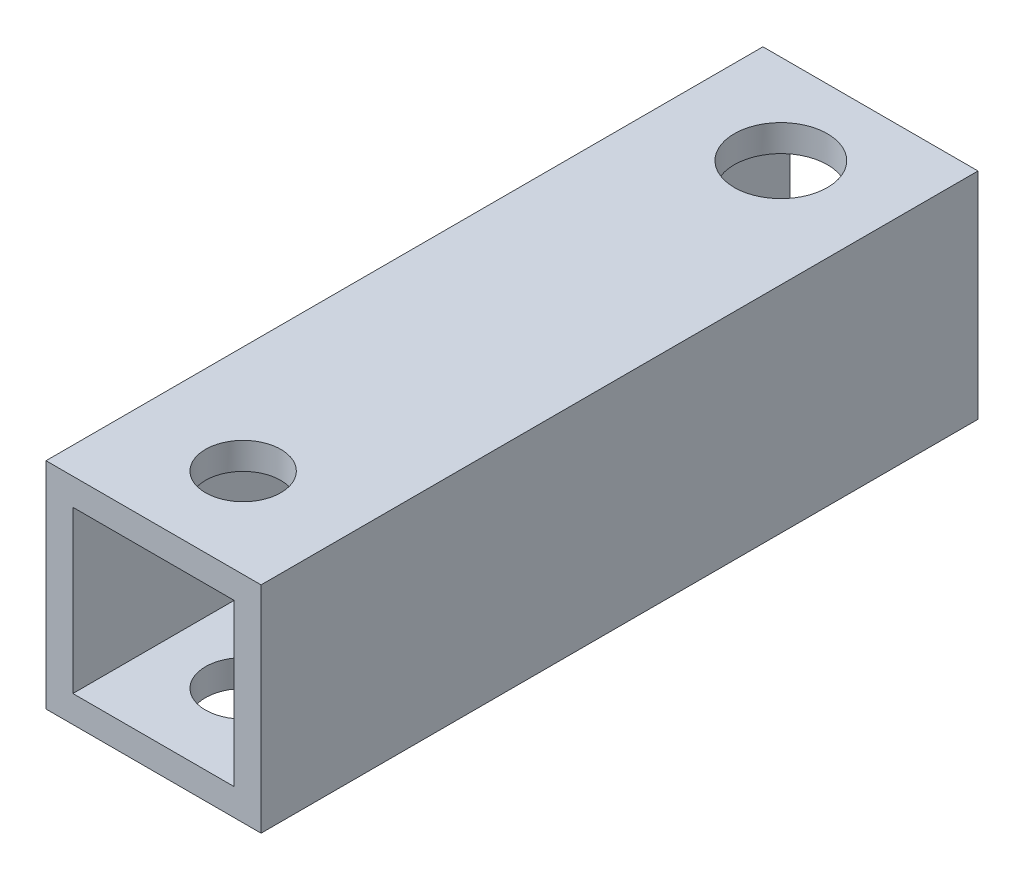
ISO-10303-21;
HEADER;
FILE_DESCRIPTION(('STEP AP214'),'2;1');
FILE_NAME('part.step','',(''),(''),'','','');
FILE_SCHEMA(('AUTOMOTIVE_DESIGN { 1 0 10303 214 1 1 1 1 }'));
ENDSEC;
DATA;
#1=APPLICATION_CONTEXT('core data for automotive mechanical design processes');
#2=APPLICATION_PROTOCOL_DEFINITION('international standard','automotive_design',2000,#1);
#3=PRODUCT_CONTEXT('',#1,'mechanical');
#4=PRODUCT('Part','Part','',(#3));
#5=PRODUCT_RELATED_PRODUCT_CATEGORY('part','',(#4));
#6=PRODUCT_DEFINITION_FORMATION('','',#4);
#7=PRODUCT_DEFINITION_CONTEXT('part definition',#1,'design');
#8=PRODUCT_DEFINITION('design','',#6,#7);
#9=PRODUCT_DEFINITION_SHAPE('','',#8);
#10=(LENGTH_UNIT() NAMED_UNIT(*) SI_UNIT(.MILLI.,.METRE.));
#11=(NAMED_UNIT(*) PLANE_ANGLE_UNIT() SI_UNIT($,.RADIAN.));
#12=(NAMED_UNIT(*) SI_UNIT($,.STERADIAN.) SOLID_ANGLE_UNIT());
#13=UNCERTAINTY_MEASURE_WITH_UNIT(LENGTH_MEASURE(1.E-05),#10,'distance_accuracy_value','');
#14=(GEOMETRIC_REPRESENTATION_CONTEXT(3) GLOBAL_UNCERTAINTY_ASSIGNED_CONTEXT((#13)) GLOBAL_UNIT_ASSIGNED_CONTEXT((#10,
#11,#12)) REPRESENTATION_CONTEXT('',''));
#15=CARTESIAN_POINT('',(0.,0.,0.));
#16=DIRECTION('',(0.,0.,1.));
#17=DIRECTION('',(1.,0.,0.));
#18=AXIS2_PLACEMENT_3D('',#15,#16,#17);
#19=CARTESIAN_POINT('',(0.,0.,40.));
#20=DIRECTION('',(0.,0.,1.));
#21=DIRECTION('',(1.,0.,0.));
#22=AXIS2_PLACEMENT_3D('',#19,#20,#21);
#23=PLANE('',#22);
#24=DIRECTION('',(0.,1.,0.));
#25=VECTOR('',#24,1.);
#26=CARTESIAN_POINT('',(6.,6.,40.));
#27=LINE('',#26,#25);
#28=CARTESIAN_POINT('',(6.,-6.,40.));
#29=VERTEX_POINT('',#28);
#30=CARTESIAN_POINT('',(6.,6.,40.));
#31=VERTEX_POINT('',#30);
#32=EDGE_CURVE('E138',#29,#31,#27,.T.);
#33=ORIENTED_EDGE('',*,*,#32,.T.);
#34=DIRECTION('',(-1.,0.,0.));
#35=VECTOR('',#34,1.);
#36=CARTESIAN_POINT('',(-6.,6.,40.));
#37=LINE('',#36,#35);
#38=CARTESIAN_POINT('',(-6.,6.,40.));
#39=VERTEX_POINT('',#38);
#40=EDGE_CURVE('E141',#31,#39,#37,.T.);
#41=ORIENTED_EDGE('',*,*,#40,.T.);
#42=DIRECTION('',(0.,-1.,0.));
#43=VECTOR('',#42,1.);
#44=CARTESIAN_POINT('',(-6.,6.,40.));
#45=LINE('',#44,#43);
#46=CARTESIAN_POINT('',(-6.,-6.,40.));
#47=VERTEX_POINT('',#46);
#48=EDGE_CURVE('E144',#39,#47,#45,.T.);
#49=ORIENTED_EDGE('',*,*,#48,.T.);
#50=DIRECTION('',(1.,0.,0.));
#51=VECTOR('',#50,1.);
#52=CARTESIAN_POINT('',(-6.,-6.,40.));
#53=LINE('',#52,#51);
#54=EDGE_CURVE('E146',#47,#29,#53,.T.);
#55=ORIENTED_EDGE('',*,*,#54,.T.);
#56=EDGE_LOOP('',(#33,#41,#49,#55));
#57=FACE_BOUND('',#56,.T.);
#58=DIRECTION('',(-1.,0.,0.));
#59=VECTOR('',#58,1.);
#60=CARTESIAN_POINT('',(-4.5,4.5,40.));
#61=LINE('',#60,#59);
#62=CARTESIAN_POINT('',(4.5,4.5,40.));
#63=VERTEX_POINT('',#62);
#64=CARTESIAN_POINT('',(-4.5,4.5,40.));
#65=VERTEX_POINT('',#64);
#66=EDGE_CURVE('E108',#63,#65,#61,.T.);
#67=ORIENTED_EDGE('',*,*,#66,.F.);
#68=DIRECTION('',(0.,1.,0.));
#69=VECTOR('',#68,1.);
#70=CARTESIAN_POINT('',(4.5,4.5,40.));
#71=LINE('',#70,#69);
#72=CARTESIAN_POINT('',(4.5,-4.5,40.));
#73=VERTEX_POINT('',#72);
#74=EDGE_CURVE('E100',#73,#63,#71,.T.);
#75=ORIENTED_EDGE('',*,*,#74,.F.);
#76=DIRECTION('',(1.,0.,0.));
#77=VECTOR('',#76,1.);
#78=CARTESIAN_POINT('',(-4.5,-4.5,40.));
#79=LINE('',#78,#77);
#80=CARTESIAN_POINT('',(-4.5,-4.5,40.));
#81=VERTEX_POINT('',#80);
#82=EDGE_CURVE('E122',#81,#73,#79,.T.);
#83=ORIENTED_EDGE('',*,*,#82,.F.);
#84=DIRECTION('',(0.,-1.,0.));
#85=VECTOR('',#84,1.);
#86=CARTESIAN_POINT('',(-4.5,4.5,40.));
#87=LINE('',#86,#85);
#88=EDGE_CURVE('E120',#65,#81,#87,.T.);
#89=ORIENTED_EDGE('',*,*,#88,.F.);
#90=EDGE_LOOP('',(#67,#75,#83,#89));
#91=FACE_BOUND('',#90,.T.);
#92=ADVANCED_FACE('F33',(#57,#91),#23,.T.);
#93=CARTESIAN_POINT('',(0.,0.,0.));
#94=DIRECTION('',(0.,0.,1.));
#95=DIRECTION('',(1.,0.,0.));
#96=AXIS2_PLACEMENT_3D('',#93,#94,#95);
#97=PLANE('',#96);
#98=DIRECTION('',(0.,1.,0.));
#99=VECTOR('',#98,1.);
#100=CARTESIAN_POINT('',(6.,6.,0.));
#101=LINE('',#100,#99);
#102=CARTESIAN_POINT('',(6.,-6.,0.));
#103=VERTEX_POINT('',#102);
#104=CARTESIAN_POINT('',(6.,6.,0.));
#105=VERTEX_POINT('',#104);
#106=EDGE_CURVE('E116',#103,#105,#101,.T.);
#107=ORIENTED_EDGE('',*,*,#106,.F.);
#108=DIRECTION('',(1.,0.,0.));
#109=VECTOR('',#108,1.);
#110=CARTESIAN_POINT('',(-6.,-6.,0.));
#111=LINE('',#110,#109);
#112=CARTESIAN_POINT('',(-6.,-6.,0.));
#113=VERTEX_POINT('',#112);
#114=EDGE_CURVE('E142',#113,#103,#111,.T.);
#115=ORIENTED_EDGE('',*,*,#114,.F.);
#116=DIRECTION('',(0.,-1.,0.));
#117=VECTOR('',#116,1.);
#118=CARTESIAN_POINT('',(-6.,6.,0.));
#119=LINE('',#118,#117);
#120=CARTESIAN_POINT('',(-6.,6.,0.));
#121=VERTEX_POINT('',#120);
#122=EDGE_CURVE('E153',#121,#113,#119,.T.);
#123=ORIENTED_EDGE('',*,*,#122,.F.);
#124=DIRECTION('',(-1.,0.,0.));
#125=VECTOR('',#124,1.);
#126=CARTESIAN_POINT('',(-6.,6.,0.));
#127=LINE('',#126,#125);
#128=EDGE_CURVE('E151',#105,#121,#127,.T.);
#129=ORIENTED_EDGE('',*,*,#128,.F.);
#130=EDGE_LOOP('',(#107,#115,#123,#129));
#131=FACE_BOUND('',#130,.T.);
#132=DIRECTION('',(0.,1.,0.));
#133=VECTOR('',#132,1.);
#134=CARTESIAN_POINT('',(4.5,4.5,0.));
#135=LINE('',#134,#133);
#136=CARTESIAN_POINT('',(4.5,-4.5,0.));
#137=VERTEX_POINT('',#136);
#138=CARTESIAN_POINT('',(4.5,4.5,0.));
#139=VERTEX_POINT('',#138);
#140=EDGE_CURVE('E58',#137,#139,#135,.T.);
#141=ORIENTED_EDGE('',*,*,#140,.T.);
#142=DIRECTION('',(-1.,0.,0.));
#143=VECTOR('',#142,1.);
#144=CARTESIAN_POINT('',(-4.5,4.5,0.));
#145=LINE('',#144,#143);
#146=CARTESIAN_POINT('',(-4.5,4.5,0.));
#147=VERTEX_POINT('',#146);
#148=EDGE_CURVE('E115',#139,#147,#145,.T.);
#149=ORIENTED_EDGE('',*,*,#148,.T.);
#150=DIRECTION('',(0.,-1.,0.));
#151=VECTOR('',#150,1.);
#152=CARTESIAN_POINT('',(-4.5,4.5,0.));
#153=LINE('',#152,#151);
#154=CARTESIAN_POINT('',(-4.5,-4.5,0.));
#155=VERTEX_POINT('',#154);
#156=EDGE_CURVE('E130',#147,#155,#153,.T.);
#157=ORIENTED_EDGE('',*,*,#156,.T.);
#158=DIRECTION('',(1.,0.,0.));
#159=VECTOR('',#158,1.);
#160=CARTESIAN_POINT('',(-4.5,-4.5,0.));
#161=LINE('',#160,#159);
#162=EDGE_CURVE('E109',#155,#137,#161,.T.);
#163=ORIENTED_EDGE('',*,*,#162,.T.);
#164=EDGE_LOOP('',(#141,#149,#157,#163));
#165=FACE_BOUND('',#164,.T.);
#166=ADVANCED_FACE('F207',(#131,#165),#97,.F.);
#167=CARTESIAN_POINT('',(6.,6.,40.));
#168=DIRECTION('',(-1.,0.,0.));
#169=DIRECTION('',(0.,-1.,0.));
#170=AXIS2_PLACEMENT_3D('',#167,#168,#169);
#171=PLANE('',#170);
#172=ORIENTED_EDGE('',*,*,#106,.T.);
#173=DIRECTION('',(0.,0.,-1.));
#174=VECTOR('',#173,1.);
#175=CARTESIAN_POINT('',(6.,6.,40.));
#176=LINE('',#175,#174);
#177=EDGE_CURVE('E11',#31,#105,#176,.T.);
#178=ORIENTED_EDGE('',*,*,#177,.F.);
#179=ORIENTED_EDGE('',*,*,#32,.F.);
#180=DIRECTION('',(0.,0.,-1.));
#181=VECTOR('',#180,1.);
#182=CARTESIAN_POINT('',(6.,-6.,40.));
#183=LINE('',#182,#181);
#184=EDGE_CURVE('E148',#29,#103,#183,.T.);
#185=ORIENTED_EDGE('',*,*,#184,.T.);
#186=EDGE_LOOP('',(#172,#178,#179,#185));
#187=FACE_BOUND('',#186,.T.);
#188=ADVANCED_FACE('F35',(#187),#171,.F.);
#189=CARTESIAN_POINT('',(-6.,6.,40.));
#190=DIRECTION('',(0.,-1.,0.));
#191=DIRECTION('',(0.,0.,-1.));
#192=AXIS2_PLACEMENT_3D('',#189,#190,#191);
#193=PLANE('',#192);
#194=CARTESIAN_POINT('',(0.,6.,5.));
#195=DIRECTION('',(0.,1.,0.));
#196=DIRECTION('',(0.,0.,1.));
#197=AXIS2_PLACEMENT_3D('',#194,#195,#196);
#198=CIRCLE('',#197,2.6);
#199=CARTESIAN_POINT('',(0.,6.,7.6));
#200=VERTEX_POINT('',#199);
#201=EDGE_CURVE('E165',#200,#200,#198,.T.);
#202=ORIENTED_EDGE('',*,*,#201,.F.);
#203=EDGE_LOOP('',(#202));
#204=FACE_BOUND('',#203,.T.);
#205=CARTESIAN_POINT('',(0.,6.,35.));
#206=DIRECTION('',(0.,1.,0.));
#207=DIRECTION('',(0.,0.,1.));
#208=AXIS2_PLACEMENT_3D('',#205,#206,#207);
#209=CIRCLE('',#208,2.1);
#210=CARTESIAN_POINT('',(0.,6.,37.1));
#211=VERTEX_POINT('',#210);
#212=EDGE_CURVE('E172',#211,#211,#209,.T.);
#213=ORIENTED_EDGE('',*,*,#212,.F.);
#214=EDGE_LOOP('',(#213));
#215=FACE_BOUND('',#214,.T.);
#216=ORIENTED_EDGE('',*,*,#128,.T.);
#217=DIRECTION('',(0.,0.,-1.));
#218=VECTOR('',#217,1.);
#219=CARTESIAN_POINT('',(-6.,6.,40.));
#220=LINE('',#219,#218);
#221=EDGE_CURVE('E42',#39,#121,#220,.T.);
#222=ORIENTED_EDGE('',*,*,#221,.F.);
#223=ORIENTED_EDGE('',*,*,#40,.F.);
#224=ORIENTED_EDGE('',*,*,#177,.T.);
#225=EDGE_LOOP('',(#216,#222,#223,#224));
#226=FACE_BOUND('',#225,.T.);
#227=ADVANCED_FACE('F222',(#204,#215,#226),#193,.F.);
#228=CARTESIAN_POINT('',(-6.,6.,40.));
#229=DIRECTION('',(1.,0.,0.));
#230=DIRECTION('',(0.,1.,0.));
#231=AXIS2_PLACEMENT_3D('',#228,#229,#230);
#232=PLANE('',#231);
#233=ORIENTED_EDGE('',*,*,#122,.T.);
#234=DIRECTION('',(0.,0.,-1.));
#235=VECTOR('',#234,1.);
#236=CARTESIAN_POINT('',(-6.,-6.,40.));
#237=LINE('',#236,#235);
#238=EDGE_CURVE('E158',#47,#113,#237,.T.);
#239=ORIENTED_EDGE('',*,*,#238,.F.);
#240=ORIENTED_EDGE('',*,*,#48,.F.);
#241=ORIENTED_EDGE('',*,*,#221,.T.);
#242=EDGE_LOOP('',(#233,#239,#240,#241));
#243=FACE_BOUND('',#242,.T.);
#244=ADVANCED_FACE('F220',(#243),#232,.F.);
#245=CARTESIAN_POINT('',(-6.,-6.,40.));
#246=DIRECTION('',(0.,1.,0.));
#247=DIRECTION('',(0.,0.,1.));
#248=AXIS2_PLACEMENT_3D('',#245,#246,#247);
#249=PLANE('',#248);
#250=CARTESIAN_POINT('',(0.,-6.,5.));
#251=DIRECTION('',(0.,1.,0.));
#252=DIRECTION('',(0.,0.,1.));
#253=AXIS2_PLACEMENT_3D('',#250,#251,#252);
#254=CIRCLE('',#253,2.6);
#255=CARTESIAN_POINT('',(0.,-6.,7.6));
#256=VERTEX_POINT('',#255);
#257=EDGE_CURVE('E128',#256,#256,#254,.T.);
#258=ORIENTED_EDGE('',*,*,#257,.T.);
#259=EDGE_LOOP('',(#258));
#260=FACE_BOUND('',#259,.T.);
#261=CARTESIAN_POINT('',(0.,-6.,35.));
#262=DIRECTION('',(0.,1.,0.));
#263=DIRECTION('',(0.,0.,1.));
#264=AXIS2_PLACEMENT_3D('',#261,#262,#263);
#265=CIRCLE('',#264,2.1);
#266=CARTESIAN_POINT('',(0.,-6.,37.1));
#267=VERTEX_POINT('',#266);
#268=EDGE_CURVE('E169',#267,#267,#265,.T.);
#269=ORIENTED_EDGE('',*,*,#268,.T.);
#270=EDGE_LOOP('',(#269));
#271=FACE_BOUND('',#270,.T.);
#272=ORIENTED_EDGE('',*,*,#114,.T.);
#273=ORIENTED_EDGE('',*,*,#184,.F.);
#274=ORIENTED_EDGE('',*,*,#54,.F.);
#275=ORIENTED_EDGE('',*,*,#238,.T.);
#276=EDGE_LOOP('',(#272,#273,#274,#275));
#277=FACE_BOUND('',#276,.T.);
#278=ADVANCED_FACE('F186',(#260,#271,#277),#249,.F.);
#279=CARTESIAN_POINT('',(4.5,4.5,40.));
#280=DIRECTION('',(-1.,0.,0.));
#281=DIRECTION('',(0.,-1.,0.));
#282=AXIS2_PLACEMENT_3D('',#279,#280,#281);
#283=PLANE('',#282);
#284=ORIENTED_EDGE('',*,*,#140,.F.);
#285=DIRECTION('',(0.,0.,-1.));
#286=VECTOR('',#285,1.);
#287=CARTESIAN_POINT('',(4.5,-4.5,40.));
#288=LINE('',#287,#286);
#289=EDGE_CURVE('E104',#73,#137,#288,.T.);
#290=ORIENTED_EDGE('',*,*,#289,.F.);
#291=ORIENTED_EDGE('',*,*,#74,.T.);
#292=DIRECTION('',(0.,0.,-1.));
#293=VECTOR('',#292,1.);
#294=CARTESIAN_POINT('',(4.5,4.5,40.));
#295=LINE('',#294,#293);
#296=EDGE_CURVE('E103',#63,#139,#295,.T.);
#297=ORIENTED_EDGE('',*,*,#296,.T.);
#298=EDGE_LOOP('',(#284,#290,#291,#297));
#299=FACE_BOUND('',#298,.T.);
#300=ADVANCED_FACE('F102',(#299),#283,.T.);
#301=CARTESIAN_POINT('',(-4.5,4.5,40.));
#302=DIRECTION('',(0.,-1.,0.));
#303=DIRECTION('',(0.,0.,-1.));
#304=AXIS2_PLACEMENT_3D('',#301,#302,#303);
#305=PLANE('',#304);
#306=CARTESIAN_POINT('',(0.,4.5,5.));
#307=DIRECTION('',(0.,-1.,0.));
#308=DIRECTION('',(0.,0.,-1.));
#309=AXIS2_PLACEMENT_3D('',#306,#307,#308);
#310=CIRCLE('',#309,2.6);
#311=CARTESIAN_POINT('',(0.,4.5,2.4));
#312=VERTEX_POINT('',#311);
#313=EDGE_CURVE('E181',#312,#312,#310,.T.);
#314=ORIENTED_EDGE('',*,*,#313,.F.);
#315=EDGE_LOOP('',(#314));
#316=FACE_BOUND('',#315,.T.);
#317=CARTESIAN_POINT('',(0.,4.5,35.));
#318=DIRECTION('',(0.,-1.,0.));
#319=DIRECTION('',(0.,0.,-1.));
#320=AXIS2_PLACEMENT_3D('',#317,#318,#319);
#321=CIRCLE('',#320,2.1);
#322=CARTESIAN_POINT('',(0.,4.5,32.9));
#323=VERTEX_POINT('',#322);
#324=EDGE_CURVE('E164',#323,#323,#321,.T.);
#325=ORIENTED_EDGE('',*,*,#324,.F.);
#326=EDGE_LOOP('',(#325));
#327=FACE_BOUND('',#326,.T.);
#328=ORIENTED_EDGE('',*,*,#148,.F.);
#329=ORIENTED_EDGE('',*,*,#296,.F.);
#330=ORIENTED_EDGE('',*,*,#66,.T.);
#331=DIRECTION('',(0.,0.,-1.));
#332=VECTOR('',#331,1.);
#333=CARTESIAN_POINT('',(-4.5,4.5,40.));
#334=LINE('',#333,#332);
#335=EDGE_CURVE('E117',#65,#147,#334,.T.);
#336=ORIENTED_EDGE('',*,*,#335,.T.);
#337=EDGE_LOOP('',(#328,#329,#330,#336));
#338=FACE_BOUND('',#337,.T.);
#339=ADVANCED_FACE('F112',(#316,#327,#338),#305,.T.);
#340=CARTESIAN_POINT('',(-4.5,4.5,40.));
#341=DIRECTION('',(1.,0.,0.));
#342=DIRECTION('',(0.,1.,0.));
#343=AXIS2_PLACEMENT_3D('',#340,#341,#342);
#344=PLANE('',#343);
#345=ORIENTED_EDGE('',*,*,#156,.F.);
#346=ORIENTED_EDGE('',*,*,#335,.F.);
#347=ORIENTED_EDGE('',*,*,#88,.T.);
#348=DIRECTION('',(0.,0.,-1.));
#349=VECTOR('',#348,1.);
#350=CARTESIAN_POINT('',(-4.5,-4.5,40.));
#351=LINE('',#350,#349);
#352=EDGE_CURVE('E50',#81,#155,#351,.T.);
#353=ORIENTED_EDGE('',*,*,#352,.T.);
#354=EDGE_LOOP('',(#345,#346,#347,#353));
#355=FACE_BOUND('',#354,.T.);
#356=ADVANCED_FACE('F247',(#355),#344,.T.);
#357=CARTESIAN_POINT('',(-4.5,-4.5,40.));
#358=DIRECTION('',(0.,1.,0.));
#359=DIRECTION('',(0.,0.,1.));
#360=AXIS2_PLACEMENT_3D('',#357,#358,#359);
#361=PLANE('',#360);
#362=CARTESIAN_POINT('',(0.,-4.5,5.));
#363=DIRECTION('',(0.,1.,0.));
#364=DIRECTION('',(0.,0.,1.));
#365=AXIS2_PLACEMENT_3D('',#362,#363,#364);
#366=CIRCLE('',#365,2.6);
#367=CARTESIAN_POINT('',(0.,-4.5,7.6));
#368=VERTEX_POINT('',#367);
#369=EDGE_CURVE('E37',#368,#368,#366,.T.);
#370=ORIENTED_EDGE('',*,*,#369,.F.);
#371=EDGE_LOOP('',(#370));
#372=FACE_BOUND('',#371,.T.);
#373=CARTESIAN_POINT('',(0.,-4.5,35.));
#374=DIRECTION('',(0.,1.,0.));
#375=DIRECTION('',(0.,0.,1.));
#376=AXIS2_PLACEMENT_3D('',#373,#374,#375);
#377=CIRCLE('',#376,2.1);
#378=CARTESIAN_POINT('',(0.,-4.5,37.1));
#379=VERTEX_POINT('',#378);
#380=EDGE_CURVE('E162',#379,#379,#377,.T.);
#381=ORIENTED_EDGE('',*,*,#380,.F.);
#382=EDGE_LOOP('',(#381));
#383=FACE_BOUND('',#382,.T.);
#384=ORIENTED_EDGE('',*,*,#162,.F.);
#385=ORIENTED_EDGE('',*,*,#352,.F.);
#386=ORIENTED_EDGE('',*,*,#82,.T.);
#387=ORIENTED_EDGE('',*,*,#289,.T.);
#388=EDGE_LOOP('',(#384,#385,#386,#387));
#389=FACE_BOUND('',#388,.T.);
#390=ADVANCED_FACE('F202',(#372,#383,#389),#361,.T.);
#391=CARTESIAN_POINT('',(0.,-24.,35.));
#392=DIRECTION('',(0.,1.,0.));
#393=DIRECTION('',(0.,0.,1.));
#394=AXIS2_PLACEMENT_3D('',#391,#392,#393);
#395=CYLINDRICAL_SURFACE('',#394,2.1);
#396=ORIENTED_EDGE('',*,*,#380,.T.);
#397=EDGE_LOOP('',(#396));
#398=FACE_BOUND('',#397,.T.);
#399=ORIENTED_EDGE('',*,*,#268,.F.);
#400=EDGE_LOOP('',(#399));
#401=FACE_BOUND('',#400,.T.);
#402=ADVANCED_FACE('F192',(#398,#401),#395,.F.);
#403=CARTESIAN_POINT('',(0.,-24.,5.));
#404=DIRECTION('',(0.,1.,0.));
#405=DIRECTION('',(0.,0.,1.));
#406=AXIS2_PLACEMENT_3D('',#403,#404,#405);
#407=CYLINDRICAL_SURFACE('',#406,2.6);
#408=ORIENTED_EDGE('',*,*,#369,.T.);
#409=EDGE_LOOP('',(#408));
#410=FACE_BOUND('',#409,.T.);
#411=ORIENTED_EDGE('',*,*,#257,.F.);
#412=EDGE_LOOP('',(#411));
#413=FACE_BOUND('',#412,.T.);
#414=ADVANCED_FACE('F189',(#410,#413),#407,.F.);
#415=ORIENTED_EDGE('',*,*,#324,.T.);
#416=EDGE_LOOP('',(#415));
#417=FACE_BOUND('',#416,.T.);
#418=ORIENTED_EDGE('',*,*,#212,.T.);
#419=EDGE_LOOP('',(#418));
#420=FACE_BOUND('',#419,.T.);
#421=ADVANCED_FACE('F191',(#417,#420),#395,.F.);
#422=ORIENTED_EDGE('',*,*,#313,.T.);
#423=EDGE_LOOP('',(#422));
#424=FACE_BOUND('',#423,.T.);
#425=ORIENTED_EDGE('',*,*,#201,.T.);
#426=EDGE_LOOP('',(#425));
#427=FACE_BOUND('',#426,.T.);
#428=ADVANCED_FACE('F195',(#424,#427),#407,.F.);
#429=CLOSED_SHELL('',(#92,#166,#188,#227,#244,#278,#300,#339,#356,#390,#402,#414,#421,#428));
#430=MANIFOLD_SOLID_BREP('B2',#429);
#431=ADVANCED_BREP_SHAPE_REPRESENTATION('',(#18,#430),#14);
#432=SHAPE_DEFINITION_REPRESENTATION(#9,#431);
ENDSEC;
END-ISO-10303-21;
